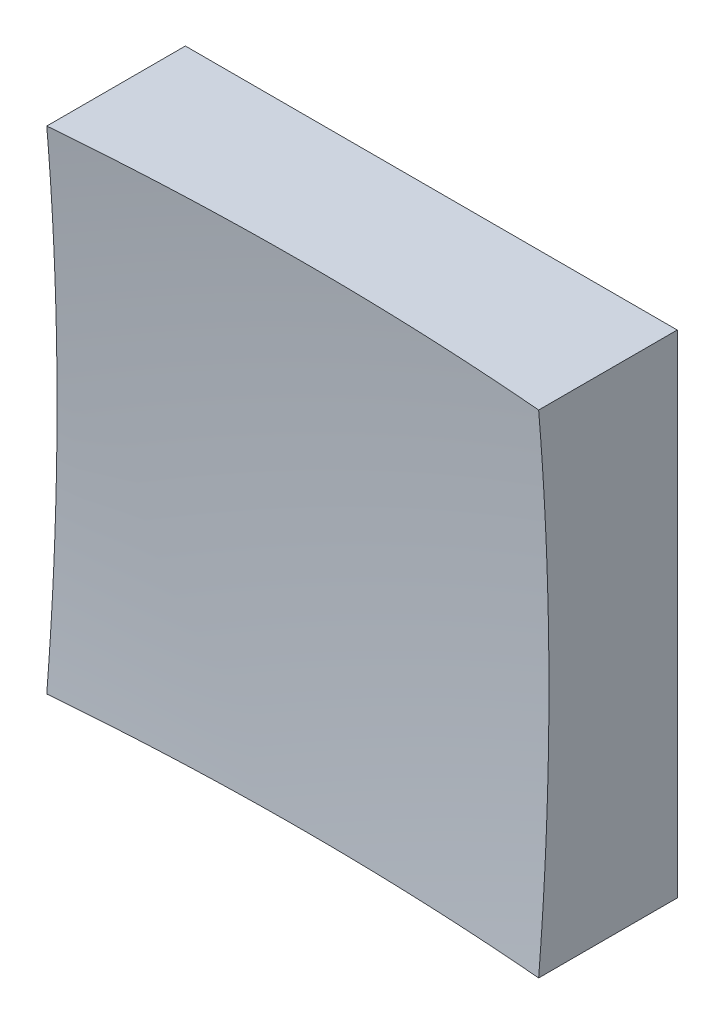
ISO-10303-21;
HEADER;
FILE_DESCRIPTION(('STEP AP214'),'2;1');
FILE_NAME('part.step','',(''),(''),'','','');
FILE_SCHEMA(('AUTOMOTIVE_DESIGN { 1 0 10303 214 1 1 1 1 }'));
ENDSEC;
DATA;
#1=APPLICATION_CONTEXT('core data for automotive mechanical design processes');
#2=APPLICATION_PROTOCOL_DEFINITION('international standard','automotive_design',2000,#1);
#3=PRODUCT_CONTEXT('',#1,'mechanical');
#4=PRODUCT('Part','Part','',(#3));
#5=PRODUCT_RELATED_PRODUCT_CATEGORY('part','',(#4));
#6=PRODUCT_DEFINITION_FORMATION('','',#4);
#7=PRODUCT_DEFINITION_CONTEXT('part definition',#1,'design');
#8=PRODUCT_DEFINITION('design','',#6,#7);
#9=PRODUCT_DEFINITION_SHAPE('','',#8);
#10=(LENGTH_UNIT() NAMED_UNIT(*) SI_UNIT(.MILLI.,.METRE.));
#11=(NAMED_UNIT(*) PLANE_ANGLE_UNIT() SI_UNIT($,.RADIAN.));
#12=(NAMED_UNIT(*) SI_UNIT($,.STERADIAN.) SOLID_ANGLE_UNIT());
#13=UNCERTAINTY_MEASURE_WITH_UNIT(LENGTH_MEASURE(1.E-05),#10,'distance_accuracy_value','');
#14=(GEOMETRIC_REPRESENTATION_CONTEXT(3) GLOBAL_UNCERTAINTY_ASSIGNED_CONTEXT((#13)) GLOBAL_UNIT_ASSIGNED_CONTEXT((#10,
#11,#12)) REPRESENTATION_CONTEXT('',''));
#15=CARTESIAN_POINT('',(0.,0.,0.));
#16=DIRECTION('',(0.,0.,1.));
#17=DIRECTION('',(1.,0.,0.));
#18=AXIS2_PLACEMENT_3D('',#15,#16,#17);
#19=CARTESIAN_POINT('',(-12.5,12.5,20.));
#20=DIRECTION('',(0.,1.,0.));
#21=DIRECTION('',(0.,0.,1.));
#22=AXIS2_PLACEMENT_3D('',#19,#20,#21);
#23=PLANE('',#22);
#24=CARTESIAN_POINT('',(0.,12.5,156.));
#25=DIRECTION('',(0.,1.,0.));
#26=DIRECTION('',(0.,0.,1.));
#27=AXIS2_PLACEMENT_3D('',#24,#25,#26);
#28=CIRCLE('',#27,149.478259288767);
#29=CARTESIAN_POINT('',(12.5,12.5,7.04530890233773));
#30=VERTEX_POINT('',#29);
#31=CARTESIAN_POINT('',(-12.5,12.5,7.04530890233773));
#32=VERTEX_POINT('',#31);
#33=EDGE_CURVE('E79',#30,#32,#28,.T.);
#34=ORIENTED_EDGE('',*,*,#33,.F.);
#35=DIRECTION('',(0.,0.,-1.));
#36=VECTOR('',#35,1.);
#37=CARTESIAN_POINT('',(12.5,12.5,20.));
#38=LINE('',#37,#36);
#39=CARTESIAN_POINT('',(12.5,12.5,0.));
#40=VERTEX_POINT('',#39);
#41=EDGE_CURVE('E85',#30,#40,#38,.T.);
#42=ORIENTED_EDGE('',*,*,#41,.T.);
#43=DIRECTION('',(1.,0.,0.));
#44=VECTOR('',#43,1.);
#45=CARTESIAN_POINT('',(-12.5,12.5,0.));
#46=LINE('',#45,#44);
#47=CARTESIAN_POINT('',(-12.5,12.5,0.));
#48=VERTEX_POINT('',#47);
#49=EDGE_CURVE('E88',#48,#40,#46,.T.);
#50=ORIENTED_EDGE('',*,*,#49,.F.);
#51=DIRECTION('',(0.,0.,-1.));
#52=VECTOR('',#51,1.);
#53=CARTESIAN_POINT('',(-12.5,12.5,20.));
#54=LINE('',#53,#52);
#55=EDGE_CURVE('E47',#32,#48,#54,.T.);
#56=ORIENTED_EDGE('',*,*,#55,.F.);
#57=EDGE_LOOP('',(#34,#42,#50,#56));
#58=FACE_BOUND('',#57,.T.);
#59=ADVANCED_FACE('F39',(#58),#23,.T.);
#60=CARTESIAN_POINT('',(-12.5,12.5,20.));
#61=DIRECTION('',(1.,0.,0.));
#62=DIRECTION('',(0.,1.,0.));
#63=AXIS2_PLACEMENT_3D('',#60,#61,#62);
#64=PLANE('',#63);
#65=DIRECTION('',(0.,0.,-1.));
#66=VECTOR('',#65,1.);
#67=CARTESIAN_POINT('',(-12.5,-12.5,20.));
#68=LINE('',#67,#66);
#69=CARTESIAN_POINT('',(-12.5,-12.5,7.04530890233773));
#70=VERTEX_POINT('',#69);
#71=CARTESIAN_POINT('',(-12.5,-12.5,0.));
#72=VERTEX_POINT('',#71);
#73=EDGE_CURVE('E100',#70,#72,#68,.T.);
#74=ORIENTED_EDGE('',*,*,#73,.F.);
#75=CARTESIAN_POINT('',(-12.5,0.,156.));
#76=DIRECTION('',(1.,0.,0.));
#77=DIRECTION('',(0.,1.,0.));
#78=AXIS2_PLACEMENT_3D('',#75,#76,#77);
#79=CIRCLE('',#78,149.478259288767);
#80=EDGE_CURVE('E89',#70,#32,#79,.T.);
#81=ORIENTED_EDGE('',*,*,#80,.T.);
#82=ORIENTED_EDGE('',*,*,#55,.T.);
#83=DIRECTION('',(0.,-1.,0.));
#84=VECTOR('',#83,1.);
#85=CARTESIAN_POINT('',(-12.5,12.5,0.));
#86=LINE('',#85,#84);
#87=EDGE_CURVE('E97',#48,#72,#86,.T.);
#88=ORIENTED_EDGE('',*,*,#87,.T.);
#89=EDGE_LOOP('',(#74,#81,#82,#88));
#90=FACE_BOUND('',#89,.T.);
#91=ADVANCED_FACE('F122',(#90),#64,.F.);
#92=CARTESIAN_POINT('',(-12.5,-12.5,20.));
#93=DIRECTION('',(0.,1.,0.));
#94=DIRECTION('',(0.,0.,1.));
#95=AXIS2_PLACEMENT_3D('',#92,#93,#94);
#96=PLANE('',#95);
#97=DIRECTION('',(0.,0.,-1.));
#98=VECTOR('',#97,1.);
#99=CARTESIAN_POINT('',(12.5,-12.5,20.));
#100=LINE('',#99,#98);
#101=CARTESIAN_POINT('',(12.5,-12.5,7.04530890233773));
#102=VERTEX_POINT('',#101);
#103=CARTESIAN_POINT('',(12.5,-12.5,0.));
#104=VERTEX_POINT('',#103);
#105=EDGE_CURVE('E96',#102,#104,#100,.T.);
#106=ORIENTED_EDGE('',*,*,#105,.F.);
#107=CARTESIAN_POINT('',(0.,-12.5,156.));
#108=DIRECTION('',(0.,1.,0.));
#109=DIRECTION('',(0.,0.,1.));
#110=AXIS2_PLACEMENT_3D('',#107,#108,#109);
#111=CIRCLE('',#110,149.478259288767);
#112=EDGE_CURVE('E53',#102,#70,#111,.T.);
#113=ORIENTED_EDGE('',*,*,#112,.T.);
#114=ORIENTED_EDGE('',*,*,#73,.T.);
#115=DIRECTION('',(1.,0.,0.));
#116=VECTOR('',#115,1.);
#117=CARTESIAN_POINT('',(-12.5,-12.5,0.));
#118=LINE('',#117,#116);
#119=EDGE_CURVE('E102',#72,#104,#118,.T.);
#120=ORIENTED_EDGE('',*,*,#119,.T.);
#121=EDGE_LOOP('',(#106,#113,#114,#120));
#122=FACE_BOUND('',#121,.T.);
#123=ADVANCED_FACE('F121',(#122),#96,.F.);
#124=CARTESIAN_POINT('',(12.5,12.5,20.));
#125=DIRECTION('',(1.,0.,0.));
#126=DIRECTION('',(0.,1.,0.));
#127=AXIS2_PLACEMENT_3D('',#124,#125,#126);
#128=PLANE('',#127);
#129=CARTESIAN_POINT('',(12.5,0.,156.));
#130=DIRECTION('',(1.,0.,0.));
#131=DIRECTION('',(0.,1.,0.));
#132=AXIS2_PLACEMENT_3D('',#129,#130,#131);
#133=CIRCLE('',#132,149.478259288767);
#134=EDGE_CURVE('E11',#102,#30,#133,.T.);
#135=ORIENTED_EDGE('',*,*,#134,.F.);
#136=ORIENTED_EDGE('',*,*,#105,.T.);
#137=DIRECTION('',(0.,-1.,0.));
#138=VECTOR('',#137,1.);
#139=CARTESIAN_POINT('',(12.5,12.5,0.));
#140=LINE('',#139,#138);
#141=EDGE_CURVE('E93',#40,#104,#140,.T.);
#142=ORIENTED_EDGE('',*,*,#141,.F.);
#143=ORIENTED_EDGE('',*,*,#41,.F.);
#144=EDGE_LOOP('',(#135,#136,#142,#143));
#145=FACE_BOUND('',#144,.T.);
#146=ADVANCED_FACE('F91',(#145),#128,.T.);
#147=CARTESIAN_POINT('',(0.,0.,0.));
#148=DIRECTION('',(0.,0.,-1.));
#149=DIRECTION('',(-1.,0.,0.));
#150=AXIS2_PLACEMENT_3D('',#147,#148,#149);
#151=PLANE('',#150);
#152=ORIENTED_EDGE('',*,*,#49,.T.);
#153=ORIENTED_EDGE('',*,*,#141,.T.);
#154=ORIENTED_EDGE('',*,*,#119,.F.);
#155=ORIENTED_EDGE('',*,*,#87,.F.);
#156=EDGE_LOOP('',(#152,#153,#154,#155));
#157=FACE_BOUND('',#156,.T.);
#158=ADVANCED_FACE('F125',(#157),#151,.T.);
#159=CARTESIAN_POINT('',(0.,0.,156.));
#160=DIRECTION('',(0.,0.,1.));
#161=DIRECTION('',(1.,0.,0.));
#162=AXIS2_PLACEMENT_3D('',#159,#160,#161);
#163=SPHERICAL_SURFACE('',#162,150.);
#164=ORIENTED_EDGE('',*,*,#33,.T.);
#165=ORIENTED_EDGE('',*,*,#80,.F.);
#166=ORIENTED_EDGE('',*,*,#112,.F.);
#167=ORIENTED_EDGE('',*,*,#134,.T.);
#168=EDGE_LOOP('',(#164,#165,#166,#167));
#169=FACE_BOUND('',#168,.T.);
#170=ADVANCED_FACE('F78',(#169),#163,.F.);
#171=CLOSED_SHELL('',(#59,#91,#123,#146,#158,#170));
#172=MANIFOLD_SOLID_BREP('B2',#171);
#173=ADVANCED_BREP_SHAPE_REPRESENTATION('',(#18,#172),#14);
#174=SHAPE_DEFINITION_REPRESENTATION(#9,#173);
ENDSEC;
END-ISO-10303-21;
